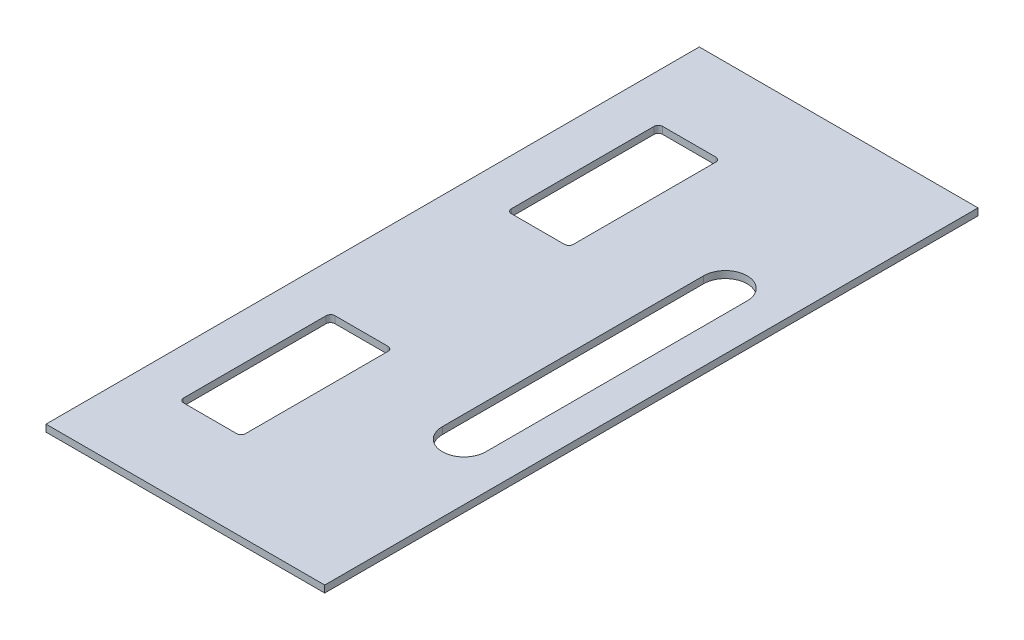
ISO-10303-21;
HEADER;
FILE_DESCRIPTION(('STEP AP214'),'2;1');
FILE_NAME('part.step','',(''),(''),'','','');
FILE_SCHEMA(('AUTOMOTIVE_DESIGN { 1 0 10303 214 1 1 1 1 }'));
ENDSEC;
DATA;
#1=APPLICATION_CONTEXT('core data for automotive mechanical design processes');
#2=APPLICATION_PROTOCOL_DEFINITION('international standard','automotive_design',2000,#1);
#3=PRODUCT_CONTEXT('',#1,'mechanical');
#4=PRODUCT('Part','Part','',(#3));
#5=PRODUCT_RELATED_PRODUCT_CATEGORY('part','',(#4));
#6=PRODUCT_DEFINITION_FORMATION('','',#4);
#7=PRODUCT_DEFINITION_CONTEXT('part definition',#1,'design');
#8=PRODUCT_DEFINITION('design','',#6,#7);
#9=PRODUCT_DEFINITION_SHAPE('','',#8);
#10=(LENGTH_UNIT() NAMED_UNIT(*) SI_UNIT(.MILLI.,.METRE.));
#11=(NAMED_UNIT(*) PLANE_ANGLE_UNIT() SI_UNIT($,.RADIAN.));
#12=(NAMED_UNIT(*) SI_UNIT($,.STERADIAN.) SOLID_ANGLE_UNIT());
#13=UNCERTAINTY_MEASURE_WITH_UNIT(LENGTH_MEASURE(1.E-05),#10,'distance_accuracy_value','');
#14=(GEOMETRIC_REPRESENTATION_CONTEXT(3) GLOBAL_UNCERTAINTY_ASSIGNED_CONTEXT((#13)) GLOBAL_UNIT_ASSIGNED_CONTEXT((#10,
#11,#12)) REPRESENTATION_CONTEXT('',''));
#15=CARTESIAN_POINT('',(0.,0.,0.));
#16=DIRECTION('',(0.,0.,1.));
#17=DIRECTION('',(1.,0.,0.));
#18=AXIS2_PLACEMENT_3D('',#15,#16,#17);
#19=CARTESIAN_POINT('',(0.,8.,0.));
#20=DIRECTION('',(0.,1.,0.));
#21=DIRECTION('',(0.,0.,1.));
#22=AXIS2_PLACEMENT_3D('',#19,#20,#21);
#23=PLANE('',#22);
#24=CARTESIAN_POINT('',(119.,8.,-105.));
#25=DIRECTION('',(0.,1.,0.));
#26=DIRECTION('',(0.,0.,1.));
#27=AXIS2_PLACEMENT_3D('',#24,#25,#26);
#28=CIRCLE('',#27,5.);
#29=CARTESIAN_POINT('',(119.,8.,-100.));
#30=VERTEX_POINT('',#29);
#31=CARTESIAN_POINT('',(124.,8.,-105.));
#32=VERTEX_POINT('',#31);
#33=EDGE_CURVE('E54',#30,#32,#28,.T.);
#34=ORIENTED_EDGE('',*,*,#33,.F.);
#35=DIRECTION('',(-1.,0.,0.));
#36=VECTOR('',#35,1.);
#37=CARTESIAN_POINT('',(119.,8.,-100.));
#38=LINE('',#37,#36);
#39=CARTESIAN_POINT('',(58.0000000000001,8.,-100.));
#40=VERTEX_POINT('',#39);
#41=EDGE_CURVE('E254',#30,#40,#38,.T.);
#42=ORIENTED_EDGE('',*,*,#41,.T.);
#43=CARTESIAN_POINT('',(58.0000000000001,8.,-105.));
#44=DIRECTION('',(0.,-1.,0.));
#45=DIRECTION('',(0.,0.,-1.));
#46=AXIS2_PLACEMENT_3D('',#43,#44,#45);
#47=CIRCLE('',#46,5.);
#48=CARTESIAN_POINT('',(53.0000000000001,8.,-105.));
#49=VERTEX_POINT('',#48);
#50=EDGE_CURVE('E257',#40,#49,#47,.T.);
#51=ORIENTED_EDGE('',*,*,#50,.T.);
#52=DIRECTION('',(0.,0.,-1.));
#53=VECTOR('',#52,1.);
#54=CARTESIAN_POINT('',(53.0000000000001,8.,-105.));
#55=LINE('',#54,#53);
#56=CARTESIAN_POINT('',(53.0000000000001,8.,-268.675816019084));
#57=VERTEX_POINT('',#56);
#58=EDGE_CURVE('E261',#49,#57,#55,.T.);
#59=ORIENTED_EDGE('',*,*,#58,.T.);
#60=CARTESIAN_POINT('',(58.0000000000001,8.,-268.675816019084));
#61=DIRECTION('',(0.,1.,0.));
#62=DIRECTION('',(0.,0.,1.));
#63=AXIS2_PLACEMENT_3D('',#60,#61,#62);
#64=CIRCLE('',#63,5.);
#65=CARTESIAN_POINT('',(58.0000000000001,8.,-273.675816019084));
#66=VERTEX_POINT('',#65);
#67=EDGE_CURVE('E264',#66,#57,#64,.T.);
#68=ORIENTED_EDGE('',*,*,#67,.F.);
#69=DIRECTION('',(-1.,0.,0.));
#70=VECTOR('',#69,1.);
#71=CARTESIAN_POINT('',(119.,8.,-273.675816019084));
#72=LINE('',#71,#70);
#73=CARTESIAN_POINT('',(119.,8.,-273.675816019084));
#74=VERTEX_POINT('',#73);
#75=EDGE_CURVE('E267',#74,#66,#72,.T.);
#76=ORIENTED_EDGE('',*,*,#75,.F.);
#77=CARTESIAN_POINT('',(119.,8.,-268.675816019084));
#78=DIRECTION('',(0.,1.,0.));
#79=DIRECTION('',(0.,0.,1.));
#80=AXIS2_PLACEMENT_3D('',#77,#78,#79);
#81=CIRCLE('',#80,5.);
#82=CARTESIAN_POINT('',(124.,8.,-268.675816019084));
#83=VERTEX_POINT('',#82);
#84=EDGE_CURVE('E270',#83,#74,#81,.T.);
#85=ORIENTED_EDGE('',*,*,#84,.F.);
#86=DIRECTION('',(0.,0.,-1.));
#87=VECTOR('',#86,1.);
#88=CARTESIAN_POINT('',(124.,8.,-105.));
#89=LINE('',#88,#87);
#90=EDGE_CURVE('E273',#32,#83,#89,.T.);
#91=ORIENTED_EDGE('',*,*,#90,.F.);
#92=EDGE_LOOP('',(#34,#42,#51,#59,#68,#76,#85,#91));
#93=FACE_BOUND('',#92,.T.);
#94=CARTESIAN_POINT('',(255.,8.,-225.));
#95=DIRECTION('',(0.,1.,0.));
#96=DIRECTION('',(0.,0.,1.));
#97=AXIS2_PLACEMENT_3D('',#94,#95,#96);
#98=CIRCLE('',#97,25.);
#99=CARTESIAN_POINT('',(230.,8.,-225.));
#100=VERTEX_POINT('',#99);
#101=CARTESIAN_POINT('',(280.,8.,-225.));
#102=VERTEX_POINT('',#101);
#103=EDGE_CURVE('E62',#100,#102,#98,.T.);
#104=ORIENTED_EDGE('',*,*,#103,.F.);
#105=DIRECTION('',(0.,0.,-1.));
#106=VECTOR('',#105,1.);
#107=CARTESIAN_POINT('',(230.,8.,-225.));
#108=LINE('',#107,#106);
#109=CARTESIAN_POINT('',(230.,8.,-525.));
#110=VERTEX_POINT('',#109);
#111=EDGE_CURVE('E207',#100,#110,#108,.T.);
#112=ORIENTED_EDGE('',*,*,#111,.T.);
#113=CARTESIAN_POINT('',(255.,8.,-525.));
#114=DIRECTION('',(0.,1.,0.));
#115=DIRECTION('',(0.,0.,1.));
#116=AXIS2_PLACEMENT_3D('',#113,#114,#115);
#117=CIRCLE('',#116,25.);
#118=CARTESIAN_POINT('',(280.,8.,-525.));
#119=VERTEX_POINT('',#118);
#120=EDGE_CURVE('E213',#119,#110,#117,.T.);
#121=ORIENTED_EDGE('',*,*,#120,.F.);
#122=DIRECTION('',(0.,0.,-1.));
#123=VECTOR('',#122,1.);
#124=CARTESIAN_POINT('',(280.,8.,-225.));
#125=LINE('',#124,#123);
#126=EDGE_CURVE('E218',#102,#119,#125,.T.);
#127=ORIENTED_EDGE('',*,*,#126,.F.);
#128=EDGE_LOOP('',(#104,#112,#121,#127));
#129=FACE_BOUND('',#128,.T.);
#130=DIRECTION('',(0.,0.,1.));
#131=VECTOR('',#130,1.);
#132=CARTESIAN_POINT('',(320.,8.,0.));
#133=LINE('',#132,#131);
#134=CARTESIAN_POINT('',(320.,8.,-750.));
#135=VERTEX_POINT('',#134);
#136=CARTESIAN_POINT('',(320.,8.,0.));
#137=VERTEX_POINT('',#136);
#138=EDGE_CURVE('E355',#135,#137,#133,.T.);
#139=ORIENTED_EDGE('',*,*,#138,.F.);
#140=DIRECTION('',(1.,0.,0.));
#141=VECTOR('',#140,1.);
#142=CARTESIAN_POINT('',(0.,8.,-750.));
#143=LINE('',#142,#141);
#144=CARTESIAN_POINT('',(0.,8.,-750.));
#145=VERTEX_POINT('',#144);
#146=EDGE_CURVE('E358',#145,#135,#143,.T.);
#147=ORIENTED_EDGE('',*,*,#146,.F.);
#148=DIRECTION('',(0.,0.,1.));
#149=VECTOR('',#148,1.);
#150=CARTESIAN_POINT('',(0.,8.,0.));
#151=LINE('',#150,#149);
#152=CARTESIAN_POINT('',(0.,8.,0.));
#153=VERTEX_POINT('',#152);
#154=EDGE_CURVE('E362',#145,#153,#151,.T.);
#155=ORIENTED_EDGE('',*,*,#154,.T.);
#156=DIRECTION('',(1.,0.,0.));
#157=VECTOR('',#156,1.);
#158=CARTESIAN_POINT('',(0.,8.,0.));
#159=LINE('',#158,#157);
#160=EDGE_CURVE('E364',#153,#137,#159,.T.);
#161=ORIENTED_EDGE('',*,*,#160,.T.);
#162=EDGE_LOOP('',(#139,#147,#155,#161));
#163=FACE_BOUND('',#162,.T.);
#164=DIRECTION('',(0.,0.,1.));
#165=VECTOR('',#164,1.);
#166=CARTESIAN_POINT('',(124.,8.,-645.));
#167=LINE('',#166,#165);
#168=CARTESIAN_POINT('',(124.,8.,-645.));
#169=VERTEX_POINT('',#168);
#170=CARTESIAN_POINT('',(124.,8.,-481.324183980916));
#171=VERTEX_POINT('',#170);
#172=EDGE_CURVE('E299',#169,#171,#167,.T.);
#173=ORIENTED_EDGE('',*,*,#172,.T.);
#174=CARTESIAN_POINT('',(119.,8.,-481.324183980916));
#175=DIRECTION('',(0.,-1.,0.));
#176=DIRECTION('',(0.,0.,-1.));
#177=AXIS2_PLACEMENT_3D('',#174,#175,#176);
#178=CIRCLE('',#177,5.);
#179=CARTESIAN_POINT('',(119.,8.,-476.324183980916));
#180=VERTEX_POINT('',#179);
#181=EDGE_CURVE('E219',#171,#180,#178,.T.);
#182=ORIENTED_EDGE('',*,*,#181,.T.);
#183=DIRECTION('',(-1.,0.,0.));
#184=VECTOR('',#183,1.);
#185=CARTESIAN_POINT('',(119.,8.,-476.324183980916));
#186=LINE('',#185,#184);
#187=CARTESIAN_POINT('',(58.0000000000001,8.,-476.324183980916));
#188=VERTEX_POINT('',#187);
#189=EDGE_CURVE('E222',#180,#188,#186,.T.);
#190=ORIENTED_EDGE('',*,*,#189,.T.);
#191=CARTESIAN_POINT('',(58.0000000000001,8.,-481.324183980916));
#192=DIRECTION('',(0.,-1.,0.));
#193=DIRECTION('',(0.,0.,-1.));
#194=AXIS2_PLACEMENT_3D('',#191,#192,#193);
#195=CIRCLE('',#194,5.);
#196=CARTESIAN_POINT('',(53.0000000000001,8.,-481.324183980916));
#197=VERTEX_POINT('',#196);
#198=EDGE_CURVE('E320',#188,#197,#195,.T.);
#199=ORIENTED_EDGE('',*,*,#198,.T.);
#200=DIRECTION('',(0.,0.,1.));
#201=VECTOR('',#200,1.);
#202=CARTESIAN_POINT('',(53.0000000000001,8.,-645.));
#203=LINE('',#202,#201);
#204=CARTESIAN_POINT('',(53.0000000000001,8.,-645.));
#205=VERTEX_POINT('',#204);
#206=EDGE_CURVE('E323',#205,#197,#203,.T.);
#207=ORIENTED_EDGE('',*,*,#206,.F.);
#208=CARTESIAN_POINT('',(58.0000000000001,8.,-645.));
#209=DIRECTION('',(0.,1.,0.));
#210=DIRECTION('',(0.,0.,1.));
#211=AXIS2_PLACEMENT_3D('',#208,#209,#210);
#212=CIRCLE('',#211,5.);
#213=CARTESIAN_POINT('',(58.0000000000001,8.,-650.));
#214=VERTEX_POINT('',#213);
#215=EDGE_CURVE('E326',#214,#205,#212,.T.);
#216=ORIENTED_EDGE('',*,*,#215,.F.);
#217=DIRECTION('',(-1.,0.,0.));
#218=VECTOR('',#217,1.);
#219=CARTESIAN_POINT('',(119.,8.,-650.));
#220=LINE('',#219,#218);
#221=CARTESIAN_POINT('',(119.,8.,-650.));
#222=VERTEX_POINT('',#221);
#223=EDGE_CURVE('E329',#222,#214,#220,.T.);
#224=ORIENTED_EDGE('',*,*,#223,.F.);
#225=CARTESIAN_POINT('',(119.,8.,-645.));
#226=DIRECTION('',(0.,-1.,0.));
#227=DIRECTION('',(0.,0.,-1.));
#228=AXIS2_PLACEMENT_3D('',#225,#226,#227);
#229=CIRCLE('',#228,4.99999999999995);
#230=EDGE_CURVE('E332',#222,#169,#229,.T.);
#231=ORIENTED_EDGE('',*,*,#230,.T.);
#232=EDGE_LOOP('',(#173,#182,#190,#199,#207,#216,#224,#231));
#233=FACE_BOUND('',#232,.T.);
#234=ADVANCED_FACE('F39',(#93,#129,#163,#233),#23,.T.);
#235=CARTESIAN_POINT('',(0.,0.,0.));
#236=DIRECTION('',(0.,1.,0.));
#237=DIRECTION('',(0.,0.,1.));
#238=AXIS2_PLACEMENT_3D('',#235,#236,#237);
#239=PLANE('',#238);
#240=DIRECTION('',(-1.,0.,0.));
#241=VECTOR('',#240,1.);
#242=CARTESIAN_POINT('',(119.,0.,-100.));
#243=LINE('',#242,#241);
#244=CARTESIAN_POINT('',(119.,0.,-100.));
#245=VERTEX_POINT('',#244);
#246=CARTESIAN_POINT('',(58.0000000000001,0.,-100.));
#247=VERTEX_POINT('',#246);
#248=EDGE_CURVE('E239',#245,#247,#243,.T.);
#249=ORIENTED_EDGE('',*,*,#248,.F.);
#250=CARTESIAN_POINT('',(119.,0.,-105.));
#251=DIRECTION('',(0.,1.,0.));
#252=DIRECTION('',(0.,0.,1.));
#253=AXIS2_PLACEMENT_3D('',#250,#251,#252);
#254=CIRCLE('',#253,5.);
#255=CARTESIAN_POINT('',(124.,0.,-105.));
#256=VERTEX_POINT('',#255);
#257=EDGE_CURVE('E258',#245,#256,#254,.T.);
#258=ORIENTED_EDGE('',*,*,#257,.T.);
#259=DIRECTION('',(0.,0.,-1.));
#260=VECTOR('',#259,1.);
#261=CARTESIAN_POINT('',(124.,0.,-105.));
#262=LINE('',#261,#260);
#263=CARTESIAN_POINT('',(124.,0.,-268.675816019084));
#264=VERTEX_POINT('',#263);
#265=EDGE_CURVE('E291',#256,#264,#262,.T.);
#266=ORIENTED_EDGE('',*,*,#265,.T.);
#267=CARTESIAN_POINT('',(119.,0.,-268.675816019084));
#268=DIRECTION('',(0.,1.,0.));
#269=DIRECTION('',(0.,0.,1.));
#270=AXIS2_PLACEMENT_3D('',#267,#268,#269);
#271=CIRCLE('',#270,5.);
#272=CARTESIAN_POINT('',(119.,0.,-273.675816019084));
#273=VERTEX_POINT('',#272);
#274=EDGE_CURVE('E288',#264,#273,#271,.T.);
#275=ORIENTED_EDGE('',*,*,#274,.T.);
#276=DIRECTION('',(-1.,0.,0.));
#277=VECTOR('',#276,1.);
#278=CARTESIAN_POINT('',(119.,0.,-273.675816019084));
#279=LINE('',#278,#277);
#280=CARTESIAN_POINT('',(58.0000000000001,0.,-273.675816019084));
#281=VERTEX_POINT('',#280);
#282=EDGE_CURVE('E285',#273,#281,#279,.T.);
#283=ORIENTED_EDGE('',*,*,#282,.T.);
#284=CARTESIAN_POINT('',(58.0000000000001,0.,-268.675816019084));
#285=DIRECTION('',(0.,1.,0.));
#286=DIRECTION('',(0.,0.,1.));
#287=AXIS2_PLACEMENT_3D('',#284,#285,#286);
#288=CIRCLE('',#287,5.);
#289=CARTESIAN_POINT('',(53.0000000000001,0.,-268.675816019084));
#290=VERTEX_POINT('',#289);
#291=EDGE_CURVE('E282',#281,#290,#288,.T.);
#292=ORIENTED_EDGE('',*,*,#291,.T.);
#293=DIRECTION('',(0.,0.,-1.));
#294=VECTOR('',#293,1.);
#295=CARTESIAN_POINT('',(53.0000000000001,0.,-105.));
#296=LINE('',#295,#294);
#297=CARTESIAN_POINT('',(53.0000000000001,0.,-105.));
#298=VERTEX_POINT('',#297);
#299=EDGE_CURVE('E280',#298,#290,#296,.T.);
#300=ORIENTED_EDGE('',*,*,#299,.F.);
#301=CARTESIAN_POINT('',(58.0000000000001,0.,-105.));
#302=DIRECTION('',(0.,-1.,0.));
#303=DIRECTION('',(0.,0.,-1.));
#304=AXIS2_PLACEMENT_3D('',#301,#302,#303);
#305=CIRCLE('',#304,5.);
#306=EDGE_CURVE('E278',#247,#298,#305,.T.);
#307=ORIENTED_EDGE('',*,*,#306,.F.);
#308=EDGE_LOOP('',(#249,#258,#266,#275,#283,#292,#300,#307));
#309=FACE_BOUND('',#308,.T.);
#310=DIRECTION('',(0.,0.,-1.));
#311=VECTOR('',#310,1.);
#312=CARTESIAN_POINT('',(230.,0.,-225.));
#313=LINE('',#312,#311);
#314=CARTESIAN_POINT('',(230.,0.,-225.));
#315=VERTEX_POINT('',#314);
#316=CARTESIAN_POINT('',(230.,0.,-525.));
#317=VERTEX_POINT('',#316);
#318=EDGE_CURVE('E227',#315,#317,#313,.T.);
#319=ORIENTED_EDGE('',*,*,#318,.F.);
#320=CARTESIAN_POINT('',(255.,0.,-225.));
#321=DIRECTION('',(0.,1.,0.));
#322=DIRECTION('',(0.,0.,1.));
#323=AXIS2_PLACEMENT_3D('',#320,#321,#322);
#324=CIRCLE('',#323,25.);
#325=CARTESIAN_POINT('',(280.,0.,-225.));
#326=VERTEX_POINT('',#325);
#327=EDGE_CURVE('E201',#315,#326,#324,.T.);
#328=ORIENTED_EDGE('',*,*,#327,.T.);
#329=DIRECTION('',(0.,0.,-1.));
#330=VECTOR('',#329,1.);
#331=CARTESIAN_POINT('',(280.,0.,-225.));
#332=LINE('',#331,#330);
#333=CARTESIAN_POINT('',(280.,0.,-525.));
#334=VERTEX_POINT('',#333);
#335=EDGE_CURVE('E233',#326,#334,#332,.T.);
#336=ORIENTED_EDGE('',*,*,#335,.T.);
#337=CARTESIAN_POINT('',(255.,0.,-525.));
#338=DIRECTION('',(0.,1.,0.));
#339=DIRECTION('',(0.,0.,1.));
#340=AXIS2_PLACEMENT_3D('',#337,#338,#339);
#341=CIRCLE('',#340,25.);
#342=EDGE_CURVE('E229',#334,#317,#341,.T.);
#343=ORIENTED_EDGE('',*,*,#342,.T.);
#344=EDGE_LOOP('',(#319,#328,#336,#343));
#345=FACE_BOUND('',#344,.T.);
#346=DIRECTION('',(0.,0.,1.));
#347=VECTOR('',#346,1.);
#348=CARTESIAN_POINT('',(320.,0.,0.));
#349=LINE('',#348,#347);
#350=CARTESIAN_POINT('',(320.,0.,-750.));
#351=VERTEX_POINT('',#350);
#352=CARTESIAN_POINT('',(320.,0.,0.));
#353=VERTEX_POINT('',#352);
#354=EDGE_CURVE('E354',#351,#353,#349,.T.);
#355=ORIENTED_EDGE('',*,*,#354,.T.);
#356=DIRECTION('',(1.,0.,0.));
#357=VECTOR('',#356,1.);
#358=CARTESIAN_POINT('',(0.,0.,0.));
#359=LINE('',#358,#357);
#360=CARTESIAN_POINT('',(0.,0.,0.));
#361=VERTEX_POINT('',#360);
#362=EDGE_CURVE('E359',#361,#353,#359,.T.);
#363=ORIENTED_EDGE('',*,*,#362,.F.);
#364=DIRECTION('',(0.,0.,1.));
#365=VECTOR('',#364,1.);
#366=CARTESIAN_POINT('',(0.,0.,0.));
#367=LINE('',#366,#365);
#368=CARTESIAN_POINT('',(0.,0.,-750.));
#369=VERTEX_POINT('',#368);
#370=EDGE_CURVE('E372',#369,#361,#367,.T.);
#371=ORIENTED_EDGE('',*,*,#370,.F.);
#372=DIRECTION('',(1.,0.,0.));
#373=VECTOR('',#372,1.);
#374=CARTESIAN_POINT('',(0.,0.,-750.));
#375=LINE('',#374,#373);
#376=EDGE_CURVE('E369',#369,#351,#375,.T.);
#377=ORIENTED_EDGE('',*,*,#376,.T.);
#378=EDGE_LOOP('',(#355,#363,#371,#377));
#379=FACE_BOUND('',#378,.T.);
#380=CARTESIAN_POINT('',(119.,0.,-481.324183980916));
#381=DIRECTION('',(0.,-1.,0.));
#382=DIRECTION('',(0.,0.,-1.));
#383=AXIS2_PLACEMENT_3D('',#380,#381,#382);
#384=CIRCLE('',#383,5.);
#385=CARTESIAN_POINT('',(124.,0.,-481.324183980916));
#386=VERTEX_POINT('',#385);
#387=CARTESIAN_POINT('',(119.,0.,-476.324183980916));
#388=VERTEX_POINT('',#387);
#389=EDGE_CURVE('E296',#386,#388,#384,.T.);
#390=ORIENTED_EDGE('',*,*,#389,.F.);
#391=DIRECTION('',(0.,0.,1.));
#392=VECTOR('',#391,1.);
#393=CARTESIAN_POINT('',(124.,0.,-645.));
#394=LINE('',#393,#392);
#395=CARTESIAN_POINT('',(124.,0.,-645.));
#396=VERTEX_POINT('',#395);
#397=EDGE_CURVE('E315',#396,#386,#394,.T.);
#398=ORIENTED_EDGE('',*,*,#397,.F.);
#399=CARTESIAN_POINT('',(119.,0.,-645.));
#400=DIRECTION('',(0.,-1.,0.));
#401=DIRECTION('',(0.,0.,-1.));
#402=AXIS2_PLACEMENT_3D('',#399,#400,#401);
#403=CIRCLE('',#402,4.99999999999995);
#404=CARTESIAN_POINT('',(119.,0.,-650.));
#405=VERTEX_POINT('',#404);
#406=EDGE_CURVE('E312',#405,#396,#403,.T.);
#407=ORIENTED_EDGE('',*,*,#406,.F.);
#408=DIRECTION('',(-1.,0.,0.));
#409=VECTOR('',#408,1.);
#410=CARTESIAN_POINT('',(119.,0.,-650.));
#411=LINE('',#410,#409);
#412=CARTESIAN_POINT('',(58.0000000000001,0.,-650.));
#413=VERTEX_POINT('',#412);
#414=EDGE_CURVE('E309',#405,#413,#411,.T.);
#415=ORIENTED_EDGE('',*,*,#414,.T.);
#416=CARTESIAN_POINT('',(58.0000000000001,0.,-645.));
#417=DIRECTION('',(0.,1.,0.));
#418=DIRECTION('',(0.,0.,1.));
#419=AXIS2_PLACEMENT_3D('',#416,#417,#418);
#420=CIRCLE('',#419,5.);
#421=CARTESIAN_POINT('',(53.0000000000001,0.,-645.));
#422=VERTEX_POINT('',#421);
#423=EDGE_CURVE('E306',#413,#422,#420,.T.);
#424=ORIENTED_EDGE('',*,*,#423,.T.);
#425=DIRECTION('',(0.,0.,1.));
#426=VECTOR('',#425,1.);
#427=CARTESIAN_POINT('',(53.0000000000001,0.,-645.));
#428=LINE('',#427,#426);
#429=CARTESIAN_POINT('',(53.0000000000001,0.,-481.324183980916));
#430=VERTEX_POINT('',#429);
#431=EDGE_CURVE('E303',#422,#430,#428,.T.);
#432=ORIENTED_EDGE('',*,*,#431,.T.);
#433=CARTESIAN_POINT('',(58.0000000000001,0.,-481.324183980916));
#434=DIRECTION('',(0.,-1.,0.));
#435=DIRECTION('',(0.,0.,-1.));
#436=AXIS2_PLACEMENT_3D('',#433,#434,#435);
#437=CIRCLE('',#436,5.);
#438=CARTESIAN_POINT('',(58.0000000000001,0.,-476.324183980916));
#439=VERTEX_POINT('',#438);
#440=EDGE_CURVE('E301',#439,#430,#437,.T.);
#441=ORIENTED_EDGE('',*,*,#440,.F.);
#442=DIRECTION('',(-1.,0.,0.));
#443=VECTOR('',#442,1.);
#444=CARTESIAN_POINT('',(119.,0.,-476.324183980916));
#445=LINE('',#444,#443);
#446=EDGE_CURVE('E298',#388,#439,#445,.T.);
#447=ORIENTED_EDGE('',*,*,#446,.F.);
#448=EDGE_LOOP('',(#390,#398,#407,#415,#424,#432,#441,#447));
#449=FACE_BOUND('',#448,.T.);
#450=ADVANCED_FACE('F389',(#309,#345,#379,#449),#239,.F.);
#451=CARTESIAN_POINT('',(320.,8.,0.));
#452=DIRECTION('',(1.,0.,0.));
#453=DIRECTION('',(0.,0.,-1.));
#454=AXIS2_PLACEMENT_3D('',#451,#452,#453);
#455=PLANE('',#454);
#456=ORIENTED_EDGE('',*,*,#354,.F.);
#457=DIRECTION('',(0.,-1.,0.));
#458=VECTOR('',#457,1.);
#459=CARTESIAN_POINT('',(320.,8.,-750.));
#460=LINE('',#459,#458);
#461=EDGE_CURVE('E11',#135,#351,#460,.T.);
#462=ORIENTED_EDGE('',*,*,#461,.F.);
#463=ORIENTED_EDGE('',*,*,#138,.T.);
#464=DIRECTION('',(0.,-1.,0.));
#465=VECTOR('',#464,1.);
#466=CARTESIAN_POINT('',(320.,8.,0.));
#467=LINE('',#466,#465);
#468=EDGE_CURVE('E366',#137,#353,#467,.T.);
#469=ORIENTED_EDGE('',*,*,#468,.T.);
#470=EDGE_LOOP('',(#456,#462,#463,#469));
#471=FACE_BOUND('',#470,.T.);
#472=ADVANCED_FACE('F41',(#471),#455,.T.);
#473=CARTESIAN_POINT('',(0.,8.,-750.));
#474=DIRECTION('',(0.,0.,-1.));
#475=DIRECTION('',(-1.,0.,0.));
#476=AXIS2_PLACEMENT_3D('',#473,#474,#475);
#477=PLANE('',#476);
#478=ORIENTED_EDGE('',*,*,#376,.F.);
#479=DIRECTION('',(0.,-1.,0.));
#480=VECTOR('',#479,1.);
#481=CARTESIAN_POINT('',(0.,8.,-750.));
#482=LINE('',#481,#480);
#483=EDGE_CURVE('E47',#145,#369,#482,.T.);
#484=ORIENTED_EDGE('',*,*,#483,.F.);
#485=ORIENTED_EDGE('',*,*,#146,.T.);
#486=ORIENTED_EDGE('',*,*,#461,.T.);
#487=EDGE_LOOP('',(#478,#484,#485,#486));
#488=FACE_BOUND('',#487,.T.);
#489=ADVANCED_FACE('F391',(#488),#477,.T.);
#490=CARTESIAN_POINT('',(0.,8.,0.));
#491=DIRECTION('',(1.,0.,0.));
#492=DIRECTION('',(0.,0.,-1.));
#493=AXIS2_PLACEMENT_3D('',#490,#491,#492);
#494=PLANE('',#493);
#495=ORIENTED_EDGE('',*,*,#370,.T.);
#496=DIRECTION('',(0.,-1.,0.));
#497=VECTOR('',#496,1.);
#498=CARTESIAN_POINT('',(0.,8.,0.));
#499=LINE('',#498,#497);
#500=EDGE_CURVE('E377',#153,#361,#499,.T.);
#501=ORIENTED_EDGE('',*,*,#500,.F.);
#502=ORIENTED_EDGE('',*,*,#154,.F.);
#503=ORIENTED_EDGE('',*,*,#483,.T.);
#504=EDGE_LOOP('',(#495,#501,#502,#503));
#505=FACE_BOUND('',#504,.T.);
#506=ADVANCED_FACE('F382',(#505),#494,.F.);
#507=CARTESIAN_POINT('',(0.,8.,0.));
#508=DIRECTION('',(0.,0.,-1.));
#509=DIRECTION('',(-1.,0.,0.));
#510=AXIS2_PLACEMENT_3D('',#507,#508,#509);
#511=PLANE('',#510);
#512=ORIENTED_EDGE('',*,*,#362,.T.);
#513=ORIENTED_EDGE('',*,*,#468,.F.);
#514=ORIENTED_EDGE('',*,*,#160,.F.);
#515=ORIENTED_EDGE('',*,*,#500,.T.);
#516=EDGE_LOOP('',(#512,#513,#514,#515));
#517=FACE_BOUND('',#516,.T.);
#518=ADVANCED_FACE('F398',(#517),#511,.F.);
#519=CARTESIAN_POINT('',(119.,0.,-481.324183980916));
#520=DIRECTION('',(0.,1.,0.));
#521=DIRECTION('',(0.,0.,1.));
#522=AXIS2_PLACEMENT_3D('',#519,#520,#521);
#523=CYLINDRICAL_SURFACE('',#522,5.);
#524=ORIENTED_EDGE('',*,*,#181,.F.);
#525=DIRECTION('',(0.,1.,0.));
#526=VECTOR('',#525,1.);
#527=CARTESIAN_POINT('',(124.,0.,-481.324183980916));
#528=LINE('',#527,#526);
#529=EDGE_CURVE('E316',#386,#171,#528,.T.);
#530=ORIENTED_EDGE('',*,*,#529,.F.);
#531=ORIENTED_EDGE('',*,*,#389,.T.);
#532=DIRECTION('',(0.,1.,0.));
#533=VECTOR('',#532,1.);
#534=CARTESIAN_POINT('',(119.,0.,-476.324183980916));
#535=LINE('',#534,#533);
#536=EDGE_CURVE('E351',#388,#180,#535,.T.);
#537=ORIENTED_EDGE('',*,*,#536,.T.);
#538=EDGE_LOOP('',(#524,#530,#531,#537));
#539=FACE_BOUND('',#538,.T.);
#540=ADVANCED_FACE('F412',(#539),#523,.F.);
#541=CARTESIAN_POINT('',(119.,0.,-476.324183980916));
#542=DIRECTION('',(0.,0.,-1.));
#543=DIRECTION('',(-1.,0.,0.));
#544=AXIS2_PLACEMENT_3D('',#541,#542,#543);
#545=PLANE('',#544);
#546=ORIENTED_EDGE('',*,*,#189,.F.);
#547=ORIENTED_EDGE('',*,*,#536,.F.);
#548=ORIENTED_EDGE('',*,*,#446,.T.);
#549=DIRECTION('',(0.,1.,0.));
#550=VECTOR('',#549,1.);
#551=CARTESIAN_POINT('',(58.0000000000001,0.,-476.324183980916));
#552=LINE('',#551,#550);
#553=EDGE_CURVE('E349',#439,#188,#552,.T.);
#554=ORIENTED_EDGE('',*,*,#553,.T.);
#555=EDGE_LOOP('',(#546,#547,#548,#554));
#556=FACE_BOUND('',#555,.T.);
#557=ADVANCED_FACE('F419',(#556),#545,.T.);
#558=CARTESIAN_POINT('',(58.0000000000001,0.,-481.324183980916));
#559=DIRECTION('',(0.,1.,0.));
#560=DIRECTION('',(0.,0.,1.));
#561=AXIS2_PLACEMENT_3D('',#558,#559,#560);
#562=CYLINDRICAL_SURFACE('',#561,5.);
#563=ORIENTED_EDGE('',*,*,#198,.F.);
#564=ORIENTED_EDGE('',*,*,#553,.F.);
#565=ORIENTED_EDGE('',*,*,#440,.T.);
#566=DIRECTION('',(0.,1.,0.));
#567=VECTOR('',#566,1.);
#568=CARTESIAN_POINT('',(53.0000000000001,0.,-481.324183980916));
#569=LINE('',#568,#567);
#570=EDGE_CURVE('E347',#430,#197,#569,.T.);
#571=ORIENTED_EDGE('',*,*,#570,.T.);
#572=EDGE_LOOP('',(#563,#564,#565,#571));
#573=FACE_BOUND('',#572,.T.);
#574=ADVANCED_FACE('F422',(#573),#562,.F.);
#575=CARTESIAN_POINT('',(53.0000000000001,0.,-645.));
#576=DIRECTION('',(-1.,0.,0.));
#577=DIRECTION('',(0.,0.,1.));
#578=AXIS2_PLACEMENT_3D('',#575,#576,#577);
#579=PLANE('',#578);
#580=ORIENTED_EDGE('',*,*,#206,.T.);
#581=ORIENTED_EDGE('',*,*,#570,.F.);
#582=ORIENTED_EDGE('',*,*,#431,.F.);
#583=DIRECTION('',(0.,1.,0.));
#584=VECTOR('',#583,1.);
#585=CARTESIAN_POINT('',(53.0000000000001,0.,-645.));
#586=LINE('',#585,#584);
#587=EDGE_CURVE('E345',#422,#205,#586,.T.);
#588=ORIENTED_EDGE('',*,*,#587,.T.);
#589=EDGE_LOOP('',(#580,#581,#582,#588));
#590=FACE_BOUND('',#589,.T.);
#591=ADVANCED_FACE('F427',(#590),#579,.F.);
#592=CARTESIAN_POINT('',(58.0000000000001,0.,-645.));
#593=DIRECTION('',(0.,1.,0.));
#594=DIRECTION('',(0.,0.,1.));
#595=AXIS2_PLACEMENT_3D('',#592,#593,#594);
#596=CYLINDRICAL_SURFACE('',#595,5.);
#597=ORIENTED_EDGE('',*,*,#215,.T.);
#598=ORIENTED_EDGE('',*,*,#587,.F.);
#599=ORIENTED_EDGE('',*,*,#423,.F.);
#600=DIRECTION('',(0.,1.,0.));
#601=VECTOR('',#600,1.);
#602=CARTESIAN_POINT('',(58.0000000000001,0.,-650.));
#603=LINE('',#602,#601);
#604=EDGE_CURVE('E343',#413,#214,#603,.T.);
#605=ORIENTED_EDGE('',*,*,#604,.T.);
#606=EDGE_LOOP('',(#597,#598,#599,#605));
#607=FACE_BOUND('',#606,.T.);
#608=ADVANCED_FACE('F431',(#607),#596,.F.);
#609=CARTESIAN_POINT('',(119.,0.,-650.));
#610=DIRECTION('',(0.,0.,-1.));
#611=DIRECTION('',(-1.,0.,0.));
#612=AXIS2_PLACEMENT_3D('',#609,#610,#611);
#613=PLANE('',#612);
#614=ORIENTED_EDGE('',*,*,#223,.T.);
#615=ORIENTED_EDGE('',*,*,#604,.F.);
#616=ORIENTED_EDGE('',*,*,#414,.F.);
#617=DIRECTION('',(0.,1.,0.));
#618=VECTOR('',#617,1.);
#619=CARTESIAN_POINT('',(119.,0.,-650.));
#620=LINE('',#619,#618);
#621=EDGE_CURVE('E341',#405,#222,#620,.T.);
#622=ORIENTED_EDGE('',*,*,#621,.T.);
#623=EDGE_LOOP('',(#614,#615,#616,#622));
#624=FACE_BOUND('',#623,.T.);
#625=ADVANCED_FACE('F434',(#624),#613,.F.);
#626=CARTESIAN_POINT('',(119.,0.,-645.));
#627=DIRECTION('',(0.,1.,0.));
#628=DIRECTION('',(0.,0.,1.));
#629=AXIS2_PLACEMENT_3D('',#626,#627,#628);
#630=CYLINDRICAL_SURFACE('',#629,4.99999999999995);
#631=ORIENTED_EDGE('',*,*,#230,.F.);
#632=ORIENTED_EDGE('',*,*,#621,.F.);
#633=ORIENTED_EDGE('',*,*,#406,.T.);
#634=DIRECTION('',(0.,1.,0.));
#635=VECTOR('',#634,1.);
#636=CARTESIAN_POINT('',(124.,0.,-645.));
#637=LINE('',#636,#635);
#638=EDGE_CURVE('E339',#396,#169,#637,.T.);
#639=ORIENTED_EDGE('',*,*,#638,.T.);
#640=EDGE_LOOP('',(#631,#632,#633,#639));
#641=FACE_BOUND('',#640,.T.);
#642=ADVANCED_FACE('F436',(#641),#630,.F.);
#643=CARTESIAN_POINT('',(124.,0.,-645.));
#644=DIRECTION('',(-1.,0.,0.));
#645=DIRECTION('',(0.,0.,1.));
#646=AXIS2_PLACEMENT_3D('',#643,#644,#645);
#647=PLANE('',#646);
#648=ORIENTED_EDGE('',*,*,#172,.F.);
#649=ORIENTED_EDGE('',*,*,#638,.F.);
#650=ORIENTED_EDGE('',*,*,#397,.T.);
#651=ORIENTED_EDGE('',*,*,#529,.T.);
#652=EDGE_LOOP('',(#648,#649,#650,#651));
#653=FACE_BOUND('',#652,.T.);
#654=ADVANCED_FACE('F407',(#653),#647,.T.);
#655=CARTESIAN_POINT('',(255.,0.,-225.));
#656=DIRECTION('',(0.,1.,0.));
#657=DIRECTION('',(0.,0.,1.));
#658=AXIS2_PLACEMENT_3D('',#655,#656,#657);
#659=CYLINDRICAL_SURFACE('',#658,25.);
#660=ORIENTED_EDGE('',*,*,#103,.T.);
#661=DIRECTION('',(0.,1.,0.));
#662=VECTOR('',#661,1.);
#663=CARTESIAN_POINT('',(280.,0.,-225.));
#664=LINE('',#663,#662);
#665=EDGE_CURVE('E230',#326,#102,#664,.T.);
#666=ORIENTED_EDGE('',*,*,#665,.F.);
#667=ORIENTED_EDGE('',*,*,#327,.F.);
#668=DIRECTION('',(0.,1.,0.));
#669=VECTOR('',#668,1.);
#670=CARTESIAN_POINT('',(230.,0.,-225.));
#671=LINE('',#670,#669);
#672=EDGE_CURVE('E197',#315,#100,#671,.T.);
#673=ORIENTED_EDGE('',*,*,#672,.T.);
#674=EDGE_LOOP('',(#660,#666,#667,#673));
#675=FACE_BOUND('',#674,.T.);
#676=ADVANCED_FACE('F199',(#675),#659,.F.);
#677=CARTESIAN_POINT('',(230.,0.,-225.));
#678=DIRECTION('',(1.,0.,0.));
#679=DIRECTION('',(0.,0.,-1.));
#680=AXIS2_PLACEMENT_3D('',#677,#678,#679);
#681=PLANE('',#680);
#682=ORIENTED_EDGE('',*,*,#111,.F.);
#683=ORIENTED_EDGE('',*,*,#672,.F.);
#684=ORIENTED_EDGE('',*,*,#318,.T.);
#685=DIRECTION('',(0.,1.,0.));
#686=VECTOR('',#685,1.);
#687=CARTESIAN_POINT('',(230.,0.,-525.));
#688=LINE('',#687,#686);
#689=EDGE_CURVE('E204',#317,#110,#688,.T.);
#690=ORIENTED_EDGE('',*,*,#689,.T.);
#691=EDGE_LOOP('',(#682,#683,#684,#690));
#692=FACE_BOUND('',#691,.T.);
#693=ADVANCED_FACE('F208',(#692),#681,.T.);
#694=CARTESIAN_POINT('',(255.,0.,-525.));
#695=DIRECTION('',(0.,1.,0.));
#696=DIRECTION('',(0.,0.,1.));
#697=AXIS2_PLACEMENT_3D('',#694,#695,#696);
#698=CYLINDRICAL_SURFACE('',#697,25.);
#699=ORIENTED_EDGE('',*,*,#120,.T.);
#700=ORIENTED_EDGE('',*,*,#689,.F.);
#701=ORIENTED_EDGE('',*,*,#342,.F.);
#702=DIRECTION('',(0.,1.,0.));
#703=VECTOR('',#702,1.);
#704=CARTESIAN_POINT('',(280.,0.,-525.));
#705=LINE('',#704,#703);
#706=EDGE_CURVE('E730',#334,#119,#705,.T.);
#707=ORIENTED_EDGE('',*,*,#706,.T.);
#708=EDGE_LOOP('',(#699,#700,#701,#707));
#709=FACE_BOUND('',#708,.T.);
#710=ADVANCED_FACE('F587',(#709),#698,.F.);
#711=CARTESIAN_POINT('',(280.,0.,-225.));
#712=DIRECTION('',(1.,0.,0.));
#713=DIRECTION('',(0.,0.,-1.));
#714=AXIS2_PLACEMENT_3D('',#711,#712,#713);
#715=PLANE('',#714);
#716=ORIENTED_EDGE('',*,*,#126,.T.);
#717=ORIENTED_EDGE('',*,*,#706,.F.);
#718=ORIENTED_EDGE('',*,*,#335,.F.);
#719=ORIENTED_EDGE('',*,*,#665,.T.);
#720=EDGE_LOOP('',(#716,#717,#718,#719));
#721=FACE_BOUND('',#720,.T.);
#722=ADVANCED_FACE('F597',(#721),#715,.F.);
#723=CARTESIAN_POINT('',(119.,0.,-105.));
#724=DIRECTION('',(0.,1.,0.));
#725=DIRECTION('',(0.,0.,1.));
#726=AXIS2_PLACEMENT_3D('',#723,#724,#725);
#727=CYLINDRICAL_SURFACE('',#726,5.);
#728=ORIENTED_EDGE('',*,*,#33,.T.);
#729=DIRECTION('',(0.,1.,0.));
#730=VECTOR('',#729,1.);
#731=CARTESIAN_POINT('',(124.,0.,-105.));
#732=LINE('',#731,#730);
#733=EDGE_CURVE('E237',#256,#32,#732,.T.);
#734=ORIENTED_EDGE('',*,*,#733,.F.);
#735=ORIENTED_EDGE('',*,*,#257,.F.);
#736=DIRECTION('',(0.,1.,0.));
#737=VECTOR('',#736,1.);
#738=CARTESIAN_POINT('',(119.,0.,-100.));
#739=LINE('',#738,#737);
#740=EDGE_CURVE('E252',#245,#30,#739,.T.);
#741=ORIENTED_EDGE('',*,*,#740,.T.);
#742=EDGE_LOOP('',(#728,#734,#735,#741));
#743=FACE_BOUND('',#742,.T.);
#744=ADVANCED_FACE('F608',(#743),#727,.F.);
#745=CARTESIAN_POINT('',(119.,0.,-100.));
#746=DIRECTION('',(0.,0.,-1.));
#747=DIRECTION('',(-1.,0.,0.));
#748=AXIS2_PLACEMENT_3D('',#745,#746,#747);
#749=PLANE('',#748);
#750=ORIENTED_EDGE('',*,*,#41,.F.);
#751=ORIENTED_EDGE('',*,*,#740,.F.);
#752=ORIENTED_EDGE('',*,*,#248,.T.);
#753=DIRECTION('',(0.,1.,0.));
#754=VECTOR('',#753,1.);
#755=CARTESIAN_POINT('',(58.0000000000001,0.,-100.));
#756=LINE('',#755,#754);
#757=EDGE_CURVE('E250',#247,#40,#756,.T.);
#758=ORIENTED_EDGE('',*,*,#757,.T.);
#759=EDGE_LOOP('',(#750,#751,#752,#758));
#760=FACE_BOUND('',#759,.T.);
#761=ADVANCED_FACE('F619',(#760),#749,.T.);
#762=CARTESIAN_POINT('',(58.0000000000001,0.,-105.));
#763=DIRECTION('',(0.,1.,0.));
#764=DIRECTION('',(0.,0.,1.));
#765=AXIS2_PLACEMENT_3D('',#762,#763,#764);
#766=CYLINDRICAL_SURFACE('',#765,5.);
#767=ORIENTED_EDGE('',*,*,#50,.F.);
#768=ORIENTED_EDGE('',*,*,#757,.F.);
#769=ORIENTED_EDGE('',*,*,#306,.T.);
#770=DIRECTION('',(0.,1.,0.));
#771=VECTOR('',#770,1.);
#772=CARTESIAN_POINT('',(53.0000000000001,0.,-105.));
#773=LINE('',#772,#771);
#774=EDGE_CURVE('E248',#298,#49,#773,.T.);
#775=ORIENTED_EDGE('',*,*,#774,.T.);
#776=EDGE_LOOP('',(#767,#768,#769,#775));
#777=FACE_BOUND('',#776,.T.);
#778=ADVANCED_FACE('F629',(#777),#766,.F.);
#779=CARTESIAN_POINT('',(53.0000000000001,0.,-105.));
#780=DIRECTION('',(1.,0.,0.));
#781=DIRECTION('',(0.,0.,-1.));
#782=AXIS2_PLACEMENT_3D('',#779,#780,#781);
#783=PLANE('',#782);
#784=ORIENTED_EDGE('',*,*,#58,.F.);
#785=ORIENTED_EDGE('',*,*,#774,.F.);
#786=ORIENTED_EDGE('',*,*,#299,.T.);
#787=DIRECTION('',(0.,1.,0.));
#788=VECTOR('',#787,1.);
#789=CARTESIAN_POINT('',(53.0000000000001,0.,-268.675816019084));
#790=LINE('',#789,#788);
#791=EDGE_CURVE('E246',#290,#57,#790,.T.);
#792=ORIENTED_EDGE('',*,*,#791,.T.);
#793=EDGE_LOOP('',(#784,#785,#786,#792));
#794=FACE_BOUND('',#793,.T.);
#795=ADVANCED_FACE('F639',(#794),#783,.T.);
#796=CARTESIAN_POINT('',(58.0000000000001,0.,-268.675816019084));
#797=DIRECTION('',(0.,1.,0.));
#798=DIRECTION('',(0.,0.,1.));
#799=AXIS2_PLACEMENT_3D('',#796,#797,#798);
#800=CYLINDRICAL_SURFACE('',#799,5.);
#801=ORIENTED_EDGE('',*,*,#67,.T.);
#802=ORIENTED_EDGE('',*,*,#791,.F.);
#803=ORIENTED_EDGE('',*,*,#291,.F.);
#804=DIRECTION('',(0.,1.,0.));
#805=VECTOR('',#804,1.);
#806=CARTESIAN_POINT('',(58.0000000000001,0.,-273.675816019084));
#807=LINE('',#806,#805);
#808=EDGE_CURVE('E244',#281,#66,#807,.T.);
#809=ORIENTED_EDGE('',*,*,#808,.T.);
#810=EDGE_LOOP('',(#801,#802,#803,#809));
#811=FACE_BOUND('',#810,.T.);
#812=ADVANCED_FACE('F650',(#811),#800,.F.);
#813=CARTESIAN_POINT('',(119.,0.,-273.675816019084));
#814=DIRECTION('',(0.,0.,-1.));
#815=DIRECTION('',(-1.,0.,0.));
#816=AXIS2_PLACEMENT_3D('',#813,#814,#815);
#817=PLANE('',#816);
#818=ORIENTED_EDGE('',*,*,#75,.T.);
#819=ORIENTED_EDGE('',*,*,#808,.F.);
#820=ORIENTED_EDGE('',*,*,#282,.F.);
#821=DIRECTION('',(0.,1.,0.));
#822=VECTOR('',#821,1.);
#823=CARTESIAN_POINT('',(119.,0.,-273.675816019084));
#824=LINE('',#823,#822);
#825=EDGE_CURVE('E242',#273,#74,#824,.T.);
#826=ORIENTED_EDGE('',*,*,#825,.T.);
#827=EDGE_LOOP('',(#818,#819,#820,#826));
#828=FACE_BOUND('',#827,.T.);
#829=ADVANCED_FACE('F661',(#828),#817,.F.);
#830=CARTESIAN_POINT('',(119.,0.,-268.675816019084));
#831=DIRECTION('',(0.,1.,0.));
#832=DIRECTION('',(0.,0.,1.));
#833=AXIS2_PLACEMENT_3D('',#830,#831,#832);
#834=CYLINDRICAL_SURFACE('',#833,5.);
#835=ORIENTED_EDGE('',*,*,#84,.T.);
#836=ORIENTED_EDGE('',*,*,#825,.F.);
#837=ORIENTED_EDGE('',*,*,#274,.F.);
#838=DIRECTION('',(0.,1.,0.));
#839=VECTOR('',#838,1.);
#840=CARTESIAN_POINT('',(124.,0.,-268.675816019084));
#841=LINE('',#840,#839);
#842=EDGE_CURVE('E240',#264,#83,#841,.T.);
#843=ORIENTED_EDGE('',*,*,#842,.T.);
#844=EDGE_LOOP('',(#835,#836,#837,#843));
#845=FACE_BOUND('',#844,.T.);
#846=ADVANCED_FACE('F672',(#845),#834,.F.);
#847=CARTESIAN_POINT('',(124.,0.,-105.));
#848=DIRECTION('',(1.,0.,0.));
#849=DIRECTION('',(0.,0.,-1.));
#850=AXIS2_PLACEMENT_3D('',#847,#848,#849);
#851=PLANE('',#850);
#852=ORIENTED_EDGE('',*,*,#90,.T.);
#853=ORIENTED_EDGE('',*,*,#842,.F.);
#854=ORIENTED_EDGE('',*,*,#265,.F.);
#855=ORIENTED_EDGE('',*,*,#733,.T.);
#856=EDGE_LOOP('',(#852,#853,#854,#855));
#857=FACE_BOUND('',#856,.T.);
#858=ADVANCED_FACE('F683',(#857),#851,.F.);
#859=CLOSED_SHELL('',(#234,#450,#472,#489,#506,#518,#540,#557,#574,#591,#608,#625,#642,#654,
#676,#693,#710,#722,#744,#761,#778,#795,#812,#829,#846,#858));
#860=MANIFOLD_SOLID_BREP('B2',#859);
#861=ADVANCED_BREP_SHAPE_REPRESENTATION('',(#18,#860),#14);
#862=SHAPE_DEFINITION_REPRESENTATION(#9,#861);
ENDSEC;
END-ISO-10303-21;
